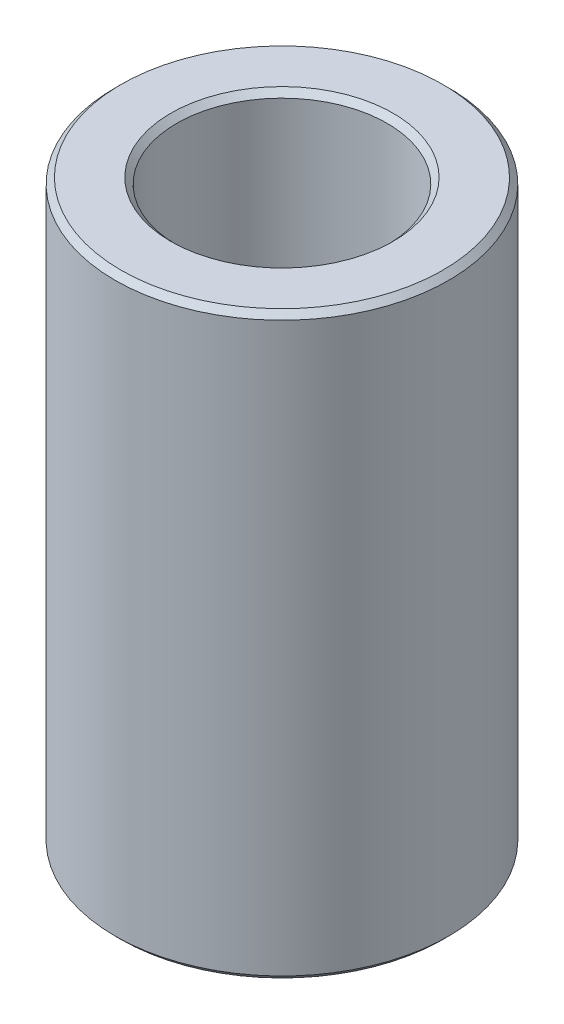
ISO-10303-21;
HEADER;
FILE_DESCRIPTION(('STEP AP214'),'2;1');
FILE_NAME('part.step','',(''),(''),'','','');
FILE_SCHEMA(('AUTOMOTIVE_DESIGN { 1 0 10303 214 1 1 1 1 }'));
ENDSEC;
DATA;
#1=APPLICATION_CONTEXT('core data for automotive mechanical design processes');
#2=APPLICATION_PROTOCOL_DEFINITION('international standard','automotive_design',2000,#1);
#3=PRODUCT_CONTEXT('',#1,'mechanical');
#4=PRODUCT('Part','Part','',(#3));
#5=PRODUCT_RELATED_PRODUCT_CATEGORY('part','',(#4));
#6=PRODUCT_DEFINITION_FORMATION('','',#4);
#7=PRODUCT_DEFINITION_CONTEXT('part definition',#1,'design');
#8=PRODUCT_DEFINITION('design','',#6,#7);
#9=PRODUCT_DEFINITION_SHAPE('','',#8);
#10=(LENGTH_UNIT() NAMED_UNIT(*) SI_UNIT(.MILLI.,.METRE.));
#11=(NAMED_UNIT(*) PLANE_ANGLE_UNIT() SI_UNIT($,.RADIAN.));
#12=(NAMED_UNIT(*) SI_UNIT($,.STERADIAN.) SOLID_ANGLE_UNIT());
#13=UNCERTAINTY_MEASURE_WITH_UNIT(LENGTH_MEASURE(1.E-05),#10,'distance_accuracy_value','');
#14=(GEOMETRIC_REPRESENTATION_CONTEXT(3) GLOBAL_UNCERTAINTY_ASSIGNED_CONTEXT((#13)) GLOBAL_UNIT_ASSIGNED_CONTEXT((#10,
#11,#12)) REPRESENTATION_CONTEXT('',''));
#15=CARTESIAN_POINT('',(0.,0.,0.));
#16=DIRECTION('',(0.,0.,1.));
#17=DIRECTION('',(1.,0.,0.));
#18=AXIS2_PLACEMENT_3D('',#15,#16,#17);
#19=CARTESIAN_POINT('',(0.,104.266360562534,0.));
#20=DIRECTION('',(0.,-1.,0.));
#21=DIRECTION('',(0.,0.,-1.));
#22=AXIS2_PLACEMENT_3D('',#19,#20,#21);
#23=CYLINDRICAL_SURFACE('',#22,30.);
#24=CARTESIAN_POINT('',(0.,1.05537700701069,0.));
#25=DIRECTION('',(0.,1.,0.));
#26=DIRECTION('',(0.,0.,1.));
#27=AXIS2_PLACEMENT_3D('',#24,#25,#26);
#28=CIRCLE('',#27,30.);
#29=CARTESIAN_POINT('',(0.,1.05537700701069,30.));
#30=VERTEX_POINT('',#29);
#31=EDGE_CURVE('E10',#30,#30,#28,.T.);
#32=ORIENTED_EDGE('',*,*,#31,.T.);
#33=EDGE_LOOP('',(#32));
#34=FACE_BOUND('',#33,.T.);
#35=CARTESIAN_POINT('',(0.,103.210983555523,0.));
#36=DIRECTION('',(0.,1.,0.));
#37=DIRECTION('',(0.,0.,1.));
#38=AXIS2_PLACEMENT_3D('',#35,#36,#37);
#39=CIRCLE('',#38,30.);
#40=CARTESIAN_POINT('',(0.,103.210983555523,30.));
#41=VERTEX_POINT('',#40);
#42=EDGE_CURVE('E50',#41,#41,#39,.F.);
#43=ORIENTED_EDGE('',*,*,#42,.T.);
#44=EDGE_LOOP('',(#43));
#45=FACE_BOUND('',#44,.T.);
#46=ADVANCED_FACE('F39',(#34,#45),#23,.T.);
#47=CARTESIAN_POINT('',(0.,104.266360562534,0.));
#48=DIRECTION('',(0.,1.,0.));
#49=DIRECTION('',(0.,0.,1.));
#50=AXIS2_PLACEMENT_3D('',#47,#48,#49);
#51=PLANE('',#50);
#52=CARTESIAN_POINT('',(0.,104.266360562534,0.));
#53=DIRECTION('',(0.,1.,0.));
#54=DIRECTION('',(0.,0.,1.));
#55=AXIS2_PLACEMENT_3D('',#52,#53,#54);
#56=CIRCLE('',#55,19.9908689209302);
#57=CARTESIAN_POINT('',(0.,104.266360562534,19.9908689209302));
#58=VERTEX_POINT('',#57);
#59=EDGE_CURVE('E58',#58,#58,#56,.F.);
#60=ORIENTED_EDGE('',*,*,#59,.T.);
#61=EDGE_LOOP('',(#60));
#62=FACE_BOUND('',#61,.T.);
#63=CARTESIAN_POINT('',(0.,104.266360562534,0.));
#64=DIRECTION('',(0.,1.,0.));
#65=DIRECTION('',(0.,0.,1.));
#66=AXIS2_PLACEMENT_3D('',#63,#64,#65);
#67=CIRCLE('',#66,28.9446229929893);
#68=CARTESIAN_POINT('',(0.,104.266360562534,28.9446229929893));
#69=VERTEX_POINT('',#68);
#70=EDGE_CURVE('E61',#69,#69,#67,.T.);
#71=ORIENTED_EDGE('',*,*,#70,.T.);
#72=EDGE_LOOP('',(#71));
#73=FACE_BOUND('',#72,.T.);
#74=ADVANCED_FACE('F88',(#62,#73),#51,.T.);
#75=CARTESIAN_POINT('',(0.,0.,0.));
#76=DIRECTION('',(0.,1.,0.));
#77=DIRECTION('',(0.,0.,1.));
#78=AXIS2_PLACEMENT_3D('',#75,#76,#77);
#79=PLANE('',#78);
#80=CARTESIAN_POINT('',(0.,0.,0.));
#81=DIRECTION('',(0.,1.,0.));
#82=DIRECTION('',(0.,0.,1.));
#83=AXIS2_PLACEMENT_3D('',#80,#81,#82);
#84=CIRCLE('',#83,19.9908689209303);
#85=CARTESIAN_POINT('',(0.,0.,19.9908689209303));
#86=VERTEX_POINT('',#85);
#87=EDGE_CURVE('E51',#86,#86,#84,.T.);
#88=ORIENTED_EDGE('',*,*,#87,.T.);
#89=EDGE_LOOP('',(#88));
#90=FACE_BOUND('',#89,.T.);
#91=CARTESIAN_POINT('',(0.,0.,0.));
#92=DIRECTION('',(0.,1.,0.));
#93=DIRECTION('',(0.,0.,1.));
#94=AXIS2_PLACEMENT_3D('',#91,#92,#93);
#95=CIRCLE('',#94,28.9446229929893);
#96=CARTESIAN_POINT('',(0.,0.,28.9446229929893));
#97=VERTEX_POINT('',#96);
#98=EDGE_CURVE('E54',#97,#97,#95,.F.);
#99=ORIENTED_EDGE('',*,*,#98,.T.);
#100=EDGE_LOOP('',(#99));
#101=FACE_BOUND('',#100,.T.);
#102=ADVANCED_FACE('F83',(#90,#101),#79,.F.);
#103=CARTESIAN_POINT('',(0.,104.266360562534,0.));
#104=DIRECTION('',(0.,-1.,0.));
#105=DIRECTION('',(0.,0.,-1.));
#106=AXIS2_PLACEMENT_3D('',#103,#104,#105);
#107=CYLINDRICAL_SURFACE('',#106,18.9354919139196);
#108=CARTESIAN_POINT('',(0.,103.210983555523,0.));
#109=DIRECTION('',(0.,1.,0.));
#110=DIRECTION('',(0.,0.,1.));
#111=AXIS2_PLACEMENT_3D('',#108,#109,#110);
#112=CIRCLE('',#111,18.9354919139196);
#113=CARTESIAN_POINT('',(0.,103.210983555523,18.9354919139196));
#114=VERTEX_POINT('',#113);
#115=EDGE_CURVE('E67',#114,#114,#112,.T.);
#116=ORIENTED_EDGE('',*,*,#115,.T.);
#117=EDGE_LOOP('',(#116));
#118=FACE_BOUND('',#117,.T.);
#119=CARTESIAN_POINT('',(0.,1.05537700701069,0.));
#120=DIRECTION('',(0.,1.,0.));
#121=DIRECTION('',(0.,0.,1.));
#122=AXIS2_PLACEMENT_3D('',#119,#120,#121);
#123=CIRCLE('',#122,18.9354919139196);
#124=CARTESIAN_POINT('',(0.,1.05537700701069,18.9354919139196));
#125=VERTEX_POINT('',#124);
#126=EDGE_CURVE('E69',#125,#125,#123,.F.);
#127=ORIENTED_EDGE('',*,*,#126,.T.);
#128=EDGE_LOOP('',(#127));
#129=FACE_BOUND('',#128,.T.);
#130=ADVANCED_FACE('F71',(#118,#129),#107,.F.);
#131=CARTESIAN_POINT('',(0.,103.210983555523,0.));
#132=DIRECTION('',(0.,1.,0.));
#133=DIRECTION('',(0.,0.,1.));
#134=AXIS2_PLACEMENT_3D('',#131,#132,#133);
#135=CONICAL_SURFACE('',#134,18.9354919139196,0.785398163397445);
#136=ORIENTED_EDGE('',*,*,#59,.F.);
#137=EDGE_LOOP('',(#136));
#138=FACE_BOUND('',#137,.T.);
#139=ORIENTED_EDGE('',*,*,#115,.F.);
#140=EDGE_LOOP('',(#139));
#141=FACE_BOUND('',#140,.T.);
#142=ADVANCED_FACE('F77',(#138,#141),#135,.F.);
#143=CARTESIAN_POINT('',(0.,0.,0.));
#144=DIRECTION('',(0.,-1.,0.));
#145=DIRECTION('',(0.,0.,-1.));
#146=AXIS2_PLACEMENT_3D('',#143,#144,#145);
#147=CONICAL_SURFACE('',#146,19.9908689209303,0.785398163397445);
#148=ORIENTED_EDGE('',*,*,#126,.F.);
#149=EDGE_LOOP('',(#148));
#150=FACE_BOUND('',#149,.T.);
#151=ORIENTED_EDGE('',*,*,#87,.F.);
#152=EDGE_LOOP('',(#151));
#153=FACE_BOUND('',#152,.T.);
#154=ADVANCED_FACE('F73',(#150,#153),#147,.F.);
#155=CARTESIAN_POINT('',(0.,1.05537700701069,0.));
#156=DIRECTION('',(0.,1.,0.));
#157=DIRECTION('',(0.,0.,1.));
#158=AXIS2_PLACEMENT_3D('',#155,#156,#157);
#159=CONICAL_SURFACE('',#158,30.,0.785398163397455);
#160=ORIENTED_EDGE('',*,*,#98,.F.);
#161=EDGE_LOOP('',(#160));
#162=FACE_BOUND('',#161,.T.);
#163=ORIENTED_EDGE('',*,*,#31,.F.);
#164=EDGE_LOOP('',(#163));
#165=FACE_BOUND('',#164,.T.);
#166=ADVANCED_FACE('F76',(#162,#165),#159,.T.);
#167=CARTESIAN_POINT('',(0.,104.266360562534,0.));
#168=DIRECTION('',(0.,-1.,0.));
#169=DIRECTION('',(0.,0.,-1.));
#170=AXIS2_PLACEMENT_3D('',#167,#168,#169);
#171=CONICAL_SURFACE('',#170,28.9446229929893,0.785398163397455);
#172=ORIENTED_EDGE('',*,*,#42,.F.);
#173=EDGE_LOOP('',(#172));
#174=FACE_BOUND('',#173,.T.);
#175=ORIENTED_EDGE('',*,*,#70,.F.);
#176=EDGE_LOOP('',(#175));
#177=FACE_BOUND('',#176,.T.);
#178=ADVANCED_FACE('F45',(#174,#177),#171,.T.);
#179=CLOSED_SHELL('',(#46,#74,#102,#130,#142,#154,#166,#178));
#180=MANIFOLD_SOLID_BREP('B2',#179);
#181=ADVANCED_BREP_SHAPE_REPRESENTATION('',(#18,#180),#14);
#182=SHAPE_DEFINITION_REPRESENTATION(#9,#181);
ENDSEC;
END-ISO-10303-21;
